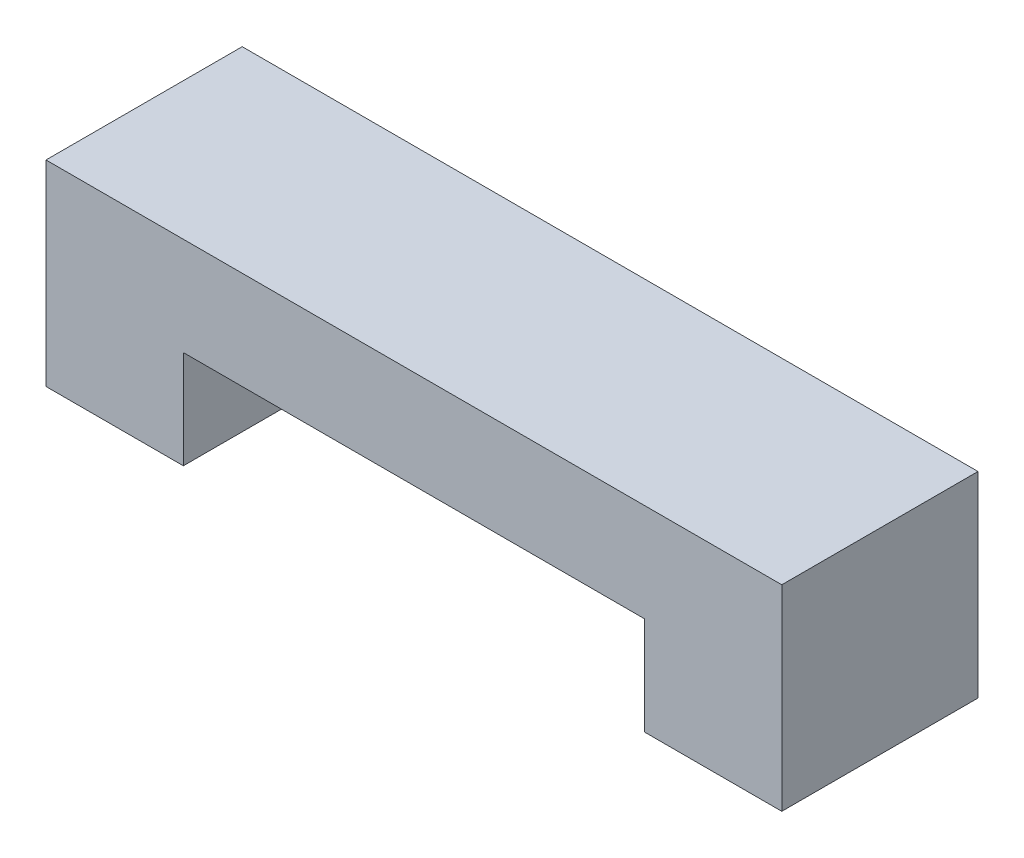
ISO-10303-21;
HEADER;
FILE_DESCRIPTION(('STEP AP214'),'2;1');
FILE_NAME('part.step','',(''),(''),'','','');
FILE_SCHEMA(('AUTOMOTIVE_DESIGN { 1 0 10303 214 1 1 1 1 }'));
ENDSEC;
DATA;
#1=APPLICATION_CONTEXT('core data for automotive mechanical design processes');
#2=APPLICATION_PROTOCOL_DEFINITION('international standard','automotive_design',2000,#1);
#3=PRODUCT_CONTEXT('',#1,'mechanical');
#4=PRODUCT('Part','Part','',(#3));
#5=PRODUCT_RELATED_PRODUCT_CATEGORY('part','',(#4));
#6=PRODUCT_DEFINITION_FORMATION('','',#4);
#7=PRODUCT_DEFINITION_CONTEXT('part definition',#1,'design');
#8=PRODUCT_DEFINITION('design','',#6,#7);
#9=PRODUCT_DEFINITION_SHAPE('','',#8);
#10=(LENGTH_UNIT() NAMED_UNIT(*) SI_UNIT(.MILLI.,.METRE.));
#11=(NAMED_UNIT(*) PLANE_ANGLE_UNIT() SI_UNIT($,.RADIAN.));
#12=(NAMED_UNIT(*) SI_UNIT($,.STERADIAN.) SOLID_ANGLE_UNIT());
#13=UNCERTAINTY_MEASURE_WITH_UNIT(LENGTH_MEASURE(1.E-05),#10,'distance_accuracy_value','');
#14=(GEOMETRIC_REPRESENTATION_CONTEXT(3) GLOBAL_UNCERTAINTY_ASSIGNED_CONTEXT((#13)) GLOBAL_UNIT_ASSIGNED_CONTEXT((#10,
#11,#12)) REPRESENTATION_CONTEXT('',''));
#15=CARTESIAN_POINT('',(0.,0.,0.));
#16=DIRECTION('',(0.,0.,1.));
#17=DIRECTION('',(1.,0.,0.));
#18=AXIS2_PLACEMENT_3D('',#15,#16,#17);
#19=CARTESIAN_POINT('',(0.,0.,0.));
#20=DIRECTION('',(0.,1.,0.));
#21=DIRECTION('',(0.,0.,1.));
#22=AXIS2_PLACEMENT_3D('',#19,#20,#21);
#23=PLANE('',#22);
#24=DIRECTION('',(1.,0.,0.));
#25=VECTOR('',#24,1.);
#26=CARTESIAN_POINT('',(0.,0.,-5.));
#27=LINE('',#26,#25);
#28=CARTESIAN_POINT('',(-11.75,0.,-5.));
#29=VERTEX_POINT('',#28);
#30=CARTESIAN_POINT('',(11.75,0.,-5.));
#31=VERTEX_POINT('',#30);
#32=EDGE_CURVE('E54',#29,#31,#27,.T.);
#33=ORIENTED_EDGE('',*,*,#32,.T.);
#34=DIRECTION('',(0.,0.,1.));
#35=VECTOR('',#34,1.);
#36=CARTESIAN_POINT('',(11.75,0.,0.));
#37=LINE('',#36,#35);
#38=CARTESIAN_POINT('',(11.75,0.,5.));
#39=VERTEX_POINT('',#38);
#40=EDGE_CURVE('E49',#31,#39,#37,.T.);
#41=ORIENTED_EDGE('',*,*,#40,.T.);
#42=DIRECTION('',(1.,0.,0.));
#43=VECTOR('',#42,1.);
#44=CARTESIAN_POINT('',(0.,0.,5.));
#45=LINE('',#44,#43);
#46=CARTESIAN_POINT('',(-11.75,0.,5.));
#47=VERTEX_POINT('',#46);
#48=EDGE_CURVE('E152',#47,#39,#45,.T.);
#49=ORIENTED_EDGE('',*,*,#48,.F.);
#50=DIRECTION('',(0.,0.,1.));
#51=VECTOR('',#50,1.);
#52=CARTESIAN_POINT('',(-11.75,0.,0.));
#53=LINE('',#52,#51);
#54=EDGE_CURVE('E128',#29,#47,#53,.T.);
#55=ORIENTED_EDGE('',*,*,#54,.F.);
#56=EDGE_LOOP('',(#33,#41,#49,#55));
#57=FACE_BOUND('',#56,.T.);
#58=ADVANCED_FACE('F34',(#57),#23,.F.);
#59=CARTESIAN_POINT('',(0.,5.,5.));
#60=DIRECTION('',(0.,0.,-1.));
#61=DIRECTION('',(-1.,0.,0.));
#62=AXIS2_PLACEMENT_3D('',#59,#60,#61);
#63=PLANE('',#62);
#64=DIRECTION('',(0.,-1.,0.));
#65=VECTOR('',#64,1.);
#66=CARTESIAN_POINT('',(-18.75,5.,5.));
#67=LINE('',#66,#65);
#68=CARTESIAN_POINT('',(-18.75,5.,5.));
#69=VERTEX_POINT('',#68);
#70=CARTESIAN_POINT('',(-18.75,-5.,5.));
#71=VERTEX_POINT('',#70);
#72=EDGE_CURVE('E165',#69,#71,#67,.T.);
#73=ORIENTED_EDGE('',*,*,#72,.T.);
#74=DIRECTION('',(1.,0.,0.));
#75=VECTOR('',#74,1.);
#76=CARTESIAN_POINT('',(0.,-5.,5.));
#77=LINE('',#76,#75);
#78=CARTESIAN_POINT('',(-11.75,-5.,5.));
#79=VERTEX_POINT('',#78);
#80=EDGE_CURVE('E140',#71,#79,#77,.T.);
#81=ORIENTED_EDGE('',*,*,#80,.T.);
#82=DIRECTION('',(0.,1.,0.));
#83=VECTOR('',#82,1.);
#84=CARTESIAN_POINT('',(-11.75,-5.,5.));
#85=LINE('',#84,#83);
#86=EDGE_CURVE('E149',#79,#47,#85,.T.);
#87=ORIENTED_EDGE('',*,*,#86,.T.);
#88=ORIENTED_EDGE('',*,*,#48,.T.);
#89=DIRECTION('',(0.,1.,0.));
#90=VECTOR('',#89,1.);
#91=CARTESIAN_POINT('',(11.75,-5.,5.));
#92=LINE('',#91,#90);
#93=CARTESIAN_POINT('',(11.75,-5.,5.));
#94=VERTEX_POINT('',#93);
#95=EDGE_CURVE('E104',#94,#39,#92,.T.);
#96=ORIENTED_EDGE('',*,*,#95,.F.);
#97=DIRECTION('',(1.,0.,0.));
#98=VECTOR('',#97,1.);
#99=CARTESIAN_POINT('',(0.,-5.,5.));
#100=LINE('',#99,#98);
#101=CARTESIAN_POINT('',(18.75,-5.,5.));
#102=VERTEX_POINT('',#101);
#103=EDGE_CURVE('E121',#94,#102,#100,.T.);
#104=ORIENTED_EDGE('',*,*,#103,.T.);
#105=DIRECTION('',(0.,-1.,0.));
#106=VECTOR('',#105,1.);
#107=CARTESIAN_POINT('',(18.75,5.,5.));
#108=LINE('',#107,#106);
#109=CARTESIAN_POINT('',(18.75,5.,5.));
#110=VERTEX_POINT('',#109);
#111=EDGE_CURVE('E146',#110,#102,#108,.T.);
#112=ORIENTED_EDGE('',*,*,#111,.F.);
#113=DIRECTION('',(1.,0.,0.));
#114=VECTOR('',#113,1.);
#115=CARTESIAN_POINT('',(0.,5.,5.));
#116=LINE('',#115,#114);
#117=EDGE_CURVE('E155',#69,#110,#116,.T.);
#118=ORIENTED_EDGE('',*,*,#117,.F.);
#119=EDGE_LOOP('',(#73,#81,#87,#88,#96,#104,#112,#118));
#120=FACE_BOUND('',#119,.T.);
#121=ADVANCED_FACE('F36',(#120),#63,.F.);
#122=CARTESIAN_POINT('',(18.75,5.,0.));
#123=DIRECTION('',(-1.,0.,0.));
#124=DIRECTION('',(0.,0.,1.));
#125=AXIS2_PLACEMENT_3D('',#122,#123,#124);
#126=PLANE('',#125);
#127=ORIENTED_EDGE('',*,*,#111,.T.);
#128=DIRECTION('',(0.,0.,-1.));
#129=VECTOR('',#128,1.);
#130=CARTESIAN_POINT('',(18.75,-5.,0.));
#131=LINE('',#130,#129);
#132=CARTESIAN_POINT('',(18.75,-5.,-5.));
#133=VERTEX_POINT('',#132);
#134=EDGE_CURVE('E105',#102,#133,#131,.T.);
#135=ORIENTED_EDGE('',*,*,#134,.T.);
#136=DIRECTION('',(0.,-1.,0.));
#137=VECTOR('',#136,1.);
#138=CARTESIAN_POINT('',(18.75,5.,-5.));
#139=LINE('',#138,#137);
#140=CARTESIAN_POINT('',(18.75,5.,-5.));
#141=VERTEX_POINT('',#140);
#142=EDGE_CURVE('E112',#141,#133,#139,.T.);
#143=ORIENTED_EDGE('',*,*,#142,.F.);
#144=DIRECTION('',(0.,0.,-1.));
#145=VECTOR('',#144,1.);
#146=CARTESIAN_POINT('',(18.75,5.,0.));
#147=LINE('',#146,#145);
#148=EDGE_CURVE('E158',#110,#141,#147,.T.);
#149=ORIENTED_EDGE('',*,*,#148,.F.);
#150=EDGE_LOOP('',(#127,#135,#143,#149));
#151=FACE_BOUND('',#150,.T.);
#152=ADVANCED_FACE('F173',(#151),#126,.F.);
#153=CARTESIAN_POINT('',(0.,5.,-5.));
#154=DIRECTION('',(0.,0.,-1.));
#155=DIRECTION('',(-1.,0.,0.));
#156=AXIS2_PLACEMENT_3D('',#153,#154,#155);
#157=PLANE('',#156);
#158=ORIENTED_EDGE('',*,*,#32,.F.);
#159=DIRECTION('',(0.,1.,0.));
#160=VECTOR('',#159,1.);
#161=CARTESIAN_POINT('',(-11.75,-5.,-5.));
#162=LINE('',#161,#160);
#163=CARTESIAN_POINT('',(-11.75,-5.,-5.));
#164=VERTEX_POINT('',#163);
#165=EDGE_CURVE('E143',#164,#29,#162,.T.);
#166=ORIENTED_EDGE('',*,*,#165,.F.);
#167=DIRECTION('',(1.,0.,0.));
#168=VECTOR('',#167,1.);
#169=CARTESIAN_POINT('',(0.,-5.,-5.));
#170=LINE('',#169,#168);
#171=CARTESIAN_POINT('',(-18.75,-5.,-5.));
#172=VERTEX_POINT('',#171);
#173=EDGE_CURVE('E135',#172,#164,#170,.T.);
#174=ORIENTED_EDGE('',*,*,#173,.F.);
#175=DIRECTION('',(0.,-1.,0.));
#176=VECTOR('',#175,1.);
#177=CARTESIAN_POINT('',(-18.75,5.,-5.));
#178=LINE('',#177,#176);
#179=CARTESIAN_POINT('',(-18.75,5.,-5.));
#180=VERTEX_POINT('',#179);
#181=EDGE_CURVE('E169',#180,#172,#178,.T.);
#182=ORIENTED_EDGE('',*,*,#181,.F.);
#183=DIRECTION('',(1.,0.,0.));
#184=VECTOR('',#183,1.);
#185=CARTESIAN_POINT('',(0.,5.,-5.));
#186=LINE('',#185,#184);
#187=EDGE_CURVE('E160',#180,#141,#186,.T.);
#188=ORIENTED_EDGE('',*,*,#187,.T.);
#189=ORIENTED_EDGE('',*,*,#142,.T.);
#190=DIRECTION('',(1.,0.,0.));
#191=VECTOR('',#190,1.);
#192=CARTESIAN_POINT('',(0.,-5.,-5.));
#193=LINE('',#192,#191);
#194=CARTESIAN_POINT('',(11.75,-5.,-5.));
#195=VERTEX_POINT('',#194);
#196=EDGE_CURVE('E108',#195,#133,#193,.T.);
#197=ORIENTED_EDGE('',*,*,#196,.F.);
#198=DIRECTION('',(0.,1.,0.));
#199=VECTOR('',#198,1.);
#200=CARTESIAN_POINT('',(11.75,-5.,-5.));
#201=LINE('',#200,#199);
#202=EDGE_CURVE('E97',#195,#31,#201,.T.);
#203=ORIENTED_EDGE('',*,*,#202,.T.);
#204=EDGE_LOOP('',(#158,#166,#174,#182,#188,#189,#197,#203));
#205=FACE_BOUND('',#204,.T.);
#206=ADVANCED_FACE('F109',(#205),#157,.T.);
#207=CARTESIAN_POINT('',(-18.75,5.,0.));
#208=DIRECTION('',(-1.,0.,0.));
#209=DIRECTION('',(0.,0.,1.));
#210=AXIS2_PLACEMENT_3D('',#207,#208,#209);
#211=PLANE('',#210);
#212=ORIENTED_EDGE('',*,*,#181,.T.);
#213=DIRECTION('',(0.,0.,-1.));
#214=VECTOR('',#213,1.);
#215=CARTESIAN_POINT('',(-18.75,-5.,0.));
#216=LINE('',#215,#214);
#217=EDGE_CURVE('E137',#71,#172,#216,.T.);
#218=ORIENTED_EDGE('',*,*,#217,.F.);
#219=ORIENTED_EDGE('',*,*,#72,.F.);
#220=DIRECTION('',(0.,0.,-1.));
#221=VECTOR('',#220,1.);
#222=CARTESIAN_POINT('',(-18.75,5.,0.));
#223=LINE('',#222,#221);
#224=EDGE_CURVE('E162',#69,#180,#223,.T.);
#225=ORIENTED_EDGE('',*,*,#224,.T.);
#226=EDGE_LOOP('',(#212,#218,#219,#225));
#227=FACE_BOUND('',#226,.T.);
#228=ADVANCED_FACE('F191',(#227),#211,.T.);
#229=CARTESIAN_POINT('',(0.,5.,0.));
#230=DIRECTION('',(0.,1.,0.));
#231=DIRECTION('',(0.,0.,1.));
#232=AXIS2_PLACEMENT_3D('',#229,#230,#231);
#233=PLANE('',#232);
#234=ORIENTED_EDGE('',*,*,#117,.T.);
#235=ORIENTED_EDGE('',*,*,#148,.T.);
#236=ORIENTED_EDGE('',*,*,#187,.F.);
#237=ORIENTED_EDGE('',*,*,#224,.F.);
#238=EDGE_LOOP('',(#234,#235,#236,#237));
#239=FACE_BOUND('',#238,.T.);
#240=ADVANCED_FACE('F190',(#239),#233,.T.);
#241=CARTESIAN_POINT('',(-11.75,-5.,0.));
#242=DIRECTION('',(-1.,0.,0.));
#243=DIRECTION('',(0.,0.,1.));
#244=AXIS2_PLACEMENT_3D('',#241,#242,#243);
#245=PLANE('',#244);
#246=ORIENTED_EDGE('',*,*,#54,.T.);
#247=ORIENTED_EDGE('',*,*,#86,.F.);
#248=DIRECTION('',(0.,0.,1.));
#249=VECTOR('',#248,1.);
#250=CARTESIAN_POINT('',(-11.75,-5.,0.));
#251=LINE('',#250,#249);
#252=EDGE_CURVE('E133',#164,#79,#251,.T.);
#253=ORIENTED_EDGE('',*,*,#252,.F.);
#254=ORIENTED_EDGE('',*,*,#165,.T.);
#255=EDGE_LOOP('',(#246,#247,#253,#254));
#256=FACE_BOUND('',#255,.T.);
#257=ADVANCED_FACE('F181',(#256),#245,.F.);
#258=CARTESIAN_POINT('',(-15.,-5.,0.));
#259=DIRECTION('',(0.,1.,0.));
#260=DIRECTION('',(0.,0.,1.));
#261=AXIS2_PLACEMENT_3D('',#258,#259,#260);
#262=CYLINDRICAL_SURFACE('',#261,1.5);
#263=CARTESIAN_POINT('',(-15.,-5.,0.));
#264=DIRECTION('',(0.,1.,0.));
#265=DIRECTION('',(0.,0.,1.));
#266=AXIS2_PLACEMENT_3D('',#263,#264,#265);
#267=CIRCLE('',#266,1.5);
#268=CARTESIAN_POINT('',(-15.,-5.,1.5));
#269=VERTEX_POINT('',#268);
#270=EDGE_CURVE('E130',#269,#269,#267,.T.);
#271=ORIENTED_EDGE('',*,*,#270,.F.);
#272=EDGE_LOOP('',(#271));
#273=FACE_BOUND('',#272,.T.);
#274=CARTESIAN_POINT('',(-15.,0.,0.));
#275=DIRECTION('',(0.,1.,0.));
#276=DIRECTION('',(0.,0.,1.));
#277=AXIS2_PLACEMENT_3D('',#274,#275,#276);
#278=CIRCLE('',#277,1.5);
#279=CARTESIAN_POINT('',(-15.,0.,1.5));
#280=VERTEX_POINT('',#279);
#281=EDGE_CURVE('E42',#280,#280,#278,.T.);
#282=ORIENTED_EDGE('',*,*,#281,.T.);
#283=EDGE_LOOP('',(#282));
#284=FACE_BOUND('',#283,.T.);
#285=ADVANCED_FACE('F230',(#273,#284),#262,.F.);
#286=CARTESIAN_POINT('',(0.,-5.,0.));
#287=DIRECTION('',(0.,1.,0.));
#288=DIRECTION('',(0.,0.,1.));
#289=AXIS2_PLACEMENT_3D('',#286,#287,#288);
#290=PLANE('',#289);
#291=ORIENTED_EDGE('',*,*,#270,.T.);
#292=EDGE_LOOP('',(#291));
#293=FACE_BOUND('',#292,.T.);
#294=ORIENTED_EDGE('',*,*,#252,.T.);
#295=ORIENTED_EDGE('',*,*,#80,.F.);
#296=ORIENTED_EDGE('',*,*,#217,.T.);
#297=ORIENTED_EDGE('',*,*,#173,.T.);
#298=EDGE_LOOP('',(#294,#295,#296,#297));
#299=FACE_BOUND('',#298,.T.);
#300=ADVANCED_FACE('F184',(#293,#299),#290,.F.);
#301=ORIENTED_EDGE('',*,*,#281,.F.);
#302=EDGE_LOOP('',(#301));
#303=FACE_BOUND('',#302,.T.);
#304=ADVANCED_FACE('F202',(#303),#23,.F.);
#305=CARTESIAN_POINT('',(15.,-5.,0.));
#306=DIRECTION('',(0.,1.,0.));
#307=DIRECTION('',(0.,0.,1.));
#308=AXIS2_PLACEMENT_3D('',#305,#306,#307);
#309=CYLINDRICAL_SURFACE('',#308,1.5);
#310=CARTESIAN_POINT('',(15.,-5.,0.));
#311=DIRECTION('',(0.,1.,0.));
#312=DIRECTION('',(0.,0.,1.));
#313=AXIS2_PLACEMENT_3D('',#310,#311,#312);
#314=CIRCLE('',#313,1.5);
#315=CARTESIAN_POINT('',(15.,-5.,1.5));
#316=VERTEX_POINT('',#315);
#317=EDGE_CURVE('E116',#316,#316,#314,.T.);
#318=ORIENTED_EDGE('',*,*,#317,.F.);
#319=EDGE_LOOP('',(#318));
#320=FACE_BOUND('',#319,.T.);
#321=CARTESIAN_POINT('',(15.,0.,0.));
#322=DIRECTION('',(0.,1.,0.));
#323=DIRECTION('',(0.,0.,1.));
#324=AXIS2_PLACEMENT_3D('',#321,#322,#323);
#325=CIRCLE('',#324,1.5);
#326=CARTESIAN_POINT('',(15.,0.,1.5));
#327=VERTEX_POINT('',#326);
#328=EDGE_CURVE('E11',#327,#327,#325,.T.);
#329=ORIENTED_EDGE('',*,*,#328,.T.);
#330=EDGE_LOOP('',(#329));
#331=FACE_BOUND('',#330,.T.);
#332=ADVANCED_FACE('F208',(#320,#331),#309,.F.);
#333=CARTESIAN_POINT('',(11.75,-5.,0.));
#334=DIRECTION('',(-1.,0.,0.));
#335=DIRECTION('',(0.,0.,1.));
#336=AXIS2_PLACEMENT_3D('',#333,#334,#335);
#337=PLANE('',#336);
#338=ORIENTED_EDGE('',*,*,#40,.F.);
#339=ORIENTED_EDGE('',*,*,#202,.F.);
#340=DIRECTION('',(0.,0.,1.));
#341=VECTOR('',#340,1.);
#342=CARTESIAN_POINT('',(11.75,-5.,0.));
#343=LINE('',#342,#341);
#344=EDGE_CURVE('E102',#195,#94,#343,.T.);
#345=ORIENTED_EDGE('',*,*,#344,.T.);
#346=ORIENTED_EDGE('',*,*,#95,.T.);
#347=EDGE_LOOP('',(#338,#339,#345,#346));
#348=FACE_BOUND('',#347,.T.);
#349=ADVANCED_FACE('F99',(#348),#337,.T.);
#350=CARTESIAN_POINT('',(0.,-5.,0.));
#351=DIRECTION('',(0.,1.,0.));
#352=DIRECTION('',(0.,0.,1.));
#353=AXIS2_PLACEMENT_3D('',#350,#351,#352);
#354=PLANE('',#353);
#355=ORIENTED_EDGE('',*,*,#317,.T.);
#356=EDGE_LOOP('',(#355));
#357=FACE_BOUND('',#356,.T.);
#358=ORIENTED_EDGE('',*,*,#196,.T.);
#359=ORIENTED_EDGE('',*,*,#134,.F.);
#360=ORIENTED_EDGE('',*,*,#103,.F.);
#361=ORIENTED_EDGE('',*,*,#344,.F.);
#362=EDGE_LOOP('',(#358,#359,#360,#361));
#363=FACE_BOUND('',#362,.T.);
#364=ADVANCED_FACE('F119',(#357,#363),#354,.F.);
#365=ORIENTED_EDGE('',*,*,#328,.F.);
#366=EDGE_LOOP('',(#365));
#367=FACE_BOUND('',#366,.T.);
#368=ADVANCED_FACE('F203',(#367),#23,.F.);
#369=CLOSED_SHELL('',(#58,#121,#152,#206,#228,#240,#257,#285,#300,#304,#332,#349,#364,#368));
#370=MANIFOLD_SOLID_BREP('B2',#369);
#371=ADVANCED_BREP_SHAPE_REPRESENTATION('',(#18,#370),#14);
#372=SHAPE_DEFINITION_REPRESENTATION(#9,#371);
ENDSEC;
END-ISO-10303-21;
